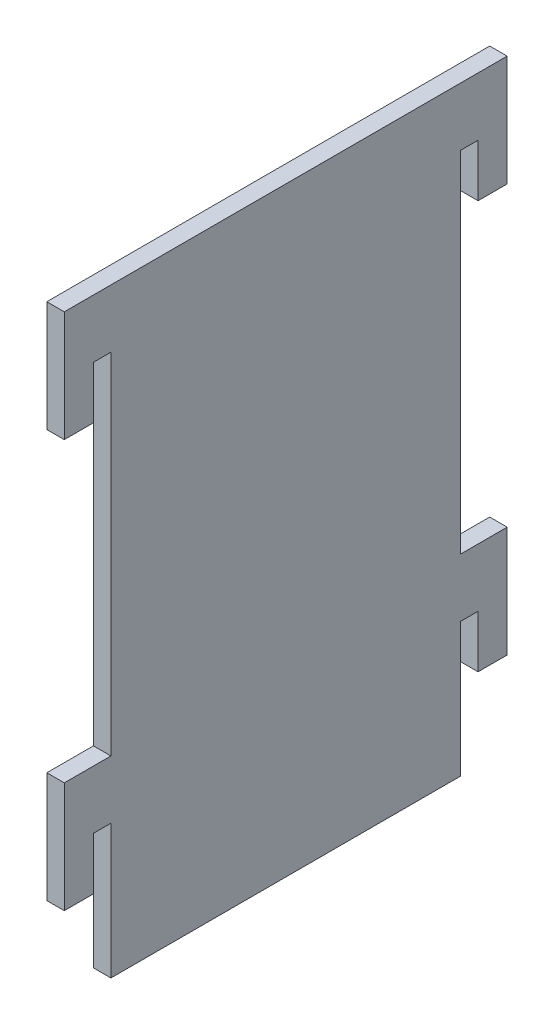
ISO-10303-21;
HEADER;
FILE_DESCRIPTION(('STEP AP214'),'2;1');
FILE_NAME('part.step','',(''),(''),'','','');
FILE_SCHEMA(('AUTOMOTIVE_DESIGN { 1 0 10303 214 1 1 1 1 }'));
ENDSEC;
DATA;
#1=APPLICATION_CONTEXT('core data for automotive mechanical design processes');
#2=APPLICATION_PROTOCOL_DEFINITION('international standard','automotive_design',2000,#1);
#3=PRODUCT_CONTEXT('',#1,'mechanical');
#4=PRODUCT('Part','Part','',(#3));
#5=PRODUCT_RELATED_PRODUCT_CATEGORY('part','',(#4));
#6=PRODUCT_DEFINITION_FORMATION('','',#4);
#7=PRODUCT_DEFINITION_CONTEXT('part definition',#1,'design');
#8=PRODUCT_DEFINITION('design','',#6,#7);
#9=PRODUCT_DEFINITION_SHAPE('','',#8);
#10=(LENGTH_UNIT() NAMED_UNIT(*) SI_UNIT(.MILLI.,.METRE.));
#11=(NAMED_UNIT(*) PLANE_ANGLE_UNIT() SI_UNIT($,.RADIAN.));
#12=(NAMED_UNIT(*) SI_UNIT($,.STERADIAN.) SOLID_ANGLE_UNIT());
#13=UNCERTAINTY_MEASURE_WITH_UNIT(LENGTH_MEASURE(1.E-05),#10,'distance_accuracy_value','');
#14=(GEOMETRIC_REPRESENTATION_CONTEXT(3) GLOBAL_UNCERTAINTY_ASSIGNED_CONTEXT((#13)) GLOBAL_UNIT_ASSIGNED_CONTEXT((#10,
#11,#12)) REPRESENTATION_CONTEXT('',''));
#15=CARTESIAN_POINT('',(0.,0.,0.));
#16=DIRECTION('',(0.,0.,1.));
#17=DIRECTION('',(1.,0.,0.));
#18=AXIS2_PLACEMENT_3D('',#15,#16,#17);
#19=CARTESIAN_POINT('',(3.,81.,5.));
#20=DIRECTION('',(0.,0.,-1.));
#21=DIRECTION('',(0.,1.,0.));
#22=AXIS2_PLACEMENT_3D('',#19,#20,#21);
#23=PLANE('',#22);
#24=DIRECTION('',(0.,-1.,0.));
#25=VECTOR('',#24,1.);
#26=CARTESIAN_POINT('',(0.,81.,5.));
#27=LINE('',#26,#25);
#28=CARTESIAN_POINT('',(0.,100.,5.));
#29=VERTEX_POINT('',#28);
#30=CARTESIAN_POINT('',(0.,81.,5.));
#31=VERTEX_POINT('',#30);
#32=EDGE_CURVE('E228',#29,#31,#27,.T.);
#33=ORIENTED_EDGE('',*,*,#32,.T.);
#34=DIRECTION('',(-1.,0.,0.));
#35=VECTOR('',#34,1.);
#36=CARTESIAN_POINT('',(3.,81.,5.));
#37=LINE('',#36,#35);
#38=CARTESIAN_POINT('',(3.,81.,5.));
#39=VERTEX_POINT('',#38);
#40=EDGE_CURVE('E43',#39,#31,#37,.T.);
#41=ORIENTED_EDGE('',*,*,#40,.F.);
#42=DIRECTION('',(0.,-1.,0.));
#43=VECTOR('',#42,1.);
#44=CARTESIAN_POINT('',(3.,81.,5.));
#45=LINE('',#44,#43);
#46=CARTESIAN_POINT('',(3.,100.,5.));
#47=VERTEX_POINT('',#46);
#48=EDGE_CURVE('E401',#47,#39,#45,.T.);
#49=ORIENTED_EDGE('',*,*,#48,.F.);
#50=DIRECTION('',(-1.,0.,0.));
#51=VECTOR('',#50,1.);
#52=CARTESIAN_POINT('',(3.,100.,5.));
#53=LINE('',#52,#51);
#54=EDGE_CURVE('E11',#47,#29,#53,.T.);
#55=ORIENTED_EDGE('',*,*,#54,.T.);
#56=EDGE_LOOP('',(#33,#41,#49,#55));
#57=FACE_BOUND('',#56,.T.);
#58=ADVANCED_FACE('F35',(#57),#23,.F.);
#59=CARTESIAN_POINT('',(3.,81.,0.));
#60=DIRECTION('',(0.,1.,0.));
#61=DIRECTION('',(0.,0.,1.));
#62=AXIS2_PLACEMENT_3D('',#59,#60,#61);
#63=PLANE('',#62);
#64=DIRECTION('',(0.,0.,-1.));
#65=VECTOR('',#64,1.);
#66=CARTESIAN_POINT('',(0.,81.,0.));
#67=LINE('',#66,#65);
#68=CARTESIAN_POINT('',(0.,81.,0.));
#69=VERTEX_POINT('',#68);
#70=EDGE_CURVE('E230',#31,#69,#67,.T.);
#71=ORIENTED_EDGE('',*,*,#70,.T.);
#72=DIRECTION('',(-1.,0.,0.));
#73=VECTOR('',#72,1.);
#74=CARTESIAN_POINT('',(3.,81.,0.));
#75=LINE('',#74,#73);
#76=CARTESIAN_POINT('',(3.,81.,0.));
#77=VERTEX_POINT('',#76);
#78=EDGE_CURVE('E327',#77,#69,#75,.T.);
#79=ORIENTED_EDGE('',*,*,#78,.F.);
#80=DIRECTION('',(0.,0.,-1.));
#81=VECTOR('',#80,1.);
#82=CARTESIAN_POINT('',(3.,81.,0.));
#83=LINE('',#82,#81);
#84=EDGE_CURVE('E336',#39,#77,#83,.T.);
#85=ORIENTED_EDGE('',*,*,#84,.F.);
#86=ORIENTED_EDGE('',*,*,#40,.T.);
#87=EDGE_LOOP('',(#71,#79,#85,#86));
#88=FACE_BOUND('',#87,.T.);
#89=ADVANCED_FACE('F334',(#88),#63,.F.);
#90=CARTESIAN_POINT('',(3.,81.,0.));
#91=DIRECTION('',(0.,0.,1.));
#92=DIRECTION('',(1.,0.,0.));
#93=AXIS2_PLACEMENT_3D('',#90,#91,#92);
#94=PLANE('',#93);
#95=DIRECTION('',(0.,1.,0.));
#96=VECTOR('',#95,1.);
#97=CARTESIAN_POINT('',(0.,81.,0.));
#98=LINE('',#97,#96);
#99=CARTESIAN_POINT('',(0.,90.,0.));
#100=VERTEX_POINT('',#99);
#101=EDGE_CURVE('E232',#69,#100,#98,.T.);
#102=ORIENTED_EDGE('',*,*,#101,.T.);
#103=DIRECTION('',(-1.,0.,0.));
#104=VECTOR('',#103,1.);
#105=CARTESIAN_POINT('',(3.,90.,0.));
#106=LINE('',#105,#104);
#107=CARTESIAN_POINT('',(3.,90.,0.));
#108=VERTEX_POINT('',#107);
#109=EDGE_CURVE('E324',#108,#100,#106,.T.);
#110=ORIENTED_EDGE('',*,*,#109,.F.);
#111=DIRECTION('',(0.,1.,0.));
#112=VECTOR('',#111,1.);
#113=CARTESIAN_POINT('',(3.,81.,0.));
#114=LINE('',#113,#112);
#115=EDGE_CURVE('E354',#77,#108,#114,.T.);
#116=ORIENTED_EDGE('',*,*,#115,.F.);
#117=ORIENTED_EDGE('',*,*,#78,.T.);
#118=EDGE_LOOP('',(#102,#110,#116,#117));
#119=FACE_BOUND('',#118,.T.);
#120=ADVANCED_FACE('F345',(#119),#94,.F.);
#121=CARTESIAN_POINT('',(3.,90.,0.));
#122=DIRECTION('',(0.,1.,0.));
#123=DIRECTION('',(0.,0.,1.));
#124=AXIS2_PLACEMENT_3D('',#121,#122,#123);
#125=PLANE('',#124);
#126=DIRECTION('',(0.,0.,-1.));
#127=VECTOR('',#126,1.);
#128=CARTESIAN_POINT('',(0.,90.,0.));
#129=LINE('',#128,#127);
#130=CARTESIAN_POINT('',(0.,90.,-3.00000000000001));
#131=VERTEX_POINT('',#130);
#132=EDGE_CURVE('E234',#100,#131,#129,.T.);
#133=ORIENTED_EDGE('',*,*,#132,.T.);
#134=DIRECTION('',(-1.,0.,0.));
#135=VECTOR('',#134,1.);
#136=CARTESIAN_POINT('',(3.,90.,-3.00000000000001));
#137=LINE('',#136,#135);
#138=CARTESIAN_POINT('',(3.,90.,-3.00000000000001));
#139=VERTEX_POINT('',#138);
#140=EDGE_CURVE('E321',#139,#131,#137,.T.);
#141=ORIENTED_EDGE('',*,*,#140,.F.);
#142=DIRECTION('',(0.,0.,-1.));
#143=VECTOR('',#142,1.);
#144=CARTESIAN_POINT('',(3.,90.,0.));
#145=LINE('',#144,#143);
#146=EDGE_CURVE('E351',#108,#139,#145,.T.);
#147=ORIENTED_EDGE('',*,*,#146,.F.);
#148=ORIENTED_EDGE('',*,*,#109,.T.);
#149=EDGE_LOOP('',(#133,#141,#147,#148));
#150=FACE_BOUND('',#149,.T.);
#151=ADVANCED_FACE('F349',(#150),#125,.F.);
#152=CARTESIAN_POINT('',(3.,90.,-3.00000000000001));
#153=DIRECTION('',(0.,0.,-1.));
#154=DIRECTION('',(0.,1.,0.));
#155=AXIS2_PLACEMENT_3D('',#152,#153,#154);
#156=PLANE('',#155);
#157=DIRECTION('',(0.,-1.,0.));
#158=VECTOR('',#157,1.);
#159=CARTESIAN_POINT('',(0.,90.,-3.00000000000001));
#160=LINE('',#159,#158);
#161=CARTESIAN_POINT('',(0.,30.,-3.00000000000002));
#162=VERTEX_POINT('',#161);
#163=EDGE_CURVE('E236',#131,#162,#160,.T.);
#164=ORIENTED_EDGE('',*,*,#163,.T.);
#165=DIRECTION('',(-1.,0.,0.));
#166=VECTOR('',#165,1.);
#167=CARTESIAN_POINT('',(3.,30.,-3.00000000000002));
#168=LINE('',#167,#166);
#169=CARTESIAN_POINT('',(3.,30.,-3.00000000000002));
#170=VERTEX_POINT('',#169);
#171=EDGE_CURVE('E318',#170,#162,#168,.T.);
#172=ORIENTED_EDGE('',*,*,#171,.F.);
#173=DIRECTION('',(0.,-1.,0.));
#174=VECTOR('',#173,1.);
#175=CARTESIAN_POINT('',(3.,90.,-3.00000000000001));
#176=LINE('',#175,#174);
#177=EDGE_CURVE('E353',#139,#170,#176,.T.);
#178=ORIENTED_EDGE('',*,*,#177,.F.);
#179=ORIENTED_EDGE('',*,*,#140,.T.);
#180=EDGE_LOOP('',(#164,#172,#178,#179));
#181=FACE_BOUND('',#180,.T.);
#182=ADVANCED_FACE('F415',(#181),#156,.F.);
#183=CARTESIAN_POINT('',(3.,30.,-3.00000000000002));
#184=DIRECTION('',(0.,-1.,0.));
#185=DIRECTION('',(0.,0.,-1.));
#186=AXIS2_PLACEMENT_3D('',#183,#184,#185);
#187=PLANE('',#186);
#188=DIRECTION('',(0.,0.,1.));
#189=VECTOR('',#188,1.);
#190=CARTESIAN_POINT('',(0.,30.,-3.00000000000002));
#191=LINE('',#190,#189);
#192=CARTESIAN_POINT('',(0.,30.,5.));
#193=VERTEX_POINT('',#192);
#194=EDGE_CURVE('E238',#162,#193,#191,.T.);
#195=ORIENTED_EDGE('',*,*,#194,.T.);
#196=DIRECTION('',(-1.,0.,0.));
#197=VECTOR('',#196,1.);
#198=CARTESIAN_POINT('',(3.,30.,5.));
#199=LINE('',#198,#197);
#200=CARTESIAN_POINT('',(3.,30.,5.));
#201=VERTEX_POINT('',#200);
#202=EDGE_CURVE('E315',#201,#193,#199,.T.);
#203=ORIENTED_EDGE('',*,*,#202,.F.);
#204=DIRECTION('',(0.,0.,1.));
#205=VECTOR('',#204,1.);
#206=CARTESIAN_POINT('',(3.,30.,-3.00000000000002));
#207=LINE('',#206,#205);
#208=EDGE_CURVE('E356',#170,#201,#207,.T.);
#209=ORIENTED_EDGE('',*,*,#208,.F.);
#210=ORIENTED_EDGE('',*,*,#171,.T.);
#211=EDGE_LOOP('',(#195,#203,#209,#210));
#212=FACE_BOUND('',#211,.T.);
#213=ADVANCED_FACE('F418',(#212),#187,.F.);
#214=CARTESIAN_POINT('',(3.,30.,5.));
#215=DIRECTION('',(0.,0.,-1.));
#216=DIRECTION('',(0.,1.,0.));
#217=AXIS2_PLACEMENT_3D('',#214,#215,#216);
#218=PLANE('',#217);
#219=DIRECTION('',(0.,-1.,0.));
#220=VECTOR('',#219,1.);
#221=CARTESIAN_POINT('',(0.,30.,5.));
#222=LINE('',#221,#220);
#223=CARTESIAN_POINT('',(0.,11.,5.));
#224=VERTEX_POINT('',#223);
#225=EDGE_CURVE('E240',#193,#224,#222,.T.);
#226=ORIENTED_EDGE('',*,*,#225,.T.);
#227=DIRECTION('',(-1.,0.,0.));
#228=VECTOR('',#227,1.);
#229=CARTESIAN_POINT('',(3.,11.,5.));
#230=LINE('',#229,#228);
#231=CARTESIAN_POINT('',(3.,11.,5.));
#232=VERTEX_POINT('',#231);
#233=EDGE_CURVE('E312',#232,#224,#230,.T.);
#234=ORIENTED_EDGE('',*,*,#233,.F.);
#235=DIRECTION('',(0.,-1.,0.));
#236=VECTOR('',#235,1.);
#237=CARTESIAN_POINT('',(3.,30.,5.));
#238=LINE('',#237,#236);
#239=EDGE_CURVE('E362',#201,#232,#238,.T.);
#240=ORIENTED_EDGE('',*,*,#239,.F.);
#241=ORIENTED_EDGE('',*,*,#202,.T.);
#242=EDGE_LOOP('',(#226,#234,#240,#241));
#243=FACE_BOUND('',#242,.T.);
#244=ADVANCED_FACE('F422',(#243),#218,.F.);
#245=CARTESIAN_POINT('',(3.,11.,0.));
#246=DIRECTION('',(0.,1.,0.));
#247=DIRECTION('',(0.,0.,1.));
#248=AXIS2_PLACEMENT_3D('',#245,#246,#247);
#249=PLANE('',#248);
#250=DIRECTION('',(0.,0.,-1.));
#251=VECTOR('',#250,1.);
#252=CARTESIAN_POINT('',(0.,11.,0.));
#253=LINE('',#252,#251);
#254=CARTESIAN_POINT('',(0.,11.,0.));
#255=VERTEX_POINT('',#254);
#256=EDGE_CURVE('E242',#224,#255,#253,.T.);
#257=ORIENTED_EDGE('',*,*,#256,.T.);
#258=DIRECTION('',(-1.,0.,0.));
#259=VECTOR('',#258,1.);
#260=CARTESIAN_POINT('',(3.,11.,0.));
#261=LINE('',#260,#259);
#262=CARTESIAN_POINT('',(3.,11.,0.));
#263=VERTEX_POINT('',#262);
#264=EDGE_CURVE('E309',#263,#255,#261,.T.);
#265=ORIENTED_EDGE('',*,*,#264,.F.);
#266=DIRECTION('',(0.,0.,-1.));
#267=VECTOR('',#266,1.);
#268=CARTESIAN_POINT('',(3.,11.,0.));
#269=LINE('',#268,#267);
#270=EDGE_CURVE('E364',#232,#263,#269,.T.);
#271=ORIENTED_EDGE('',*,*,#270,.F.);
#272=ORIENTED_EDGE('',*,*,#233,.T.);
#273=EDGE_LOOP('',(#257,#265,#271,#272));
#274=FACE_BOUND('',#273,.T.);
#275=ADVANCED_FACE('F426',(#274),#249,.F.);
#276=CARTESIAN_POINT('',(3.,20.,0.));
#277=DIRECTION('',(0.,0.,1.));
#278=DIRECTION('',(1.,0.,0.));
#279=AXIS2_PLACEMENT_3D('',#276,#277,#278);
#280=PLANE('',#279);
#281=DIRECTION('',(0.,1.,0.));
#282=VECTOR('',#281,1.);
#283=CARTESIAN_POINT('',(0.,20.,0.));
#284=LINE('',#283,#282);
#285=CARTESIAN_POINT('',(0.,20.,0.));
#286=VERTEX_POINT('',#285);
#287=EDGE_CURVE('E244',#255,#286,#284,.T.);
#288=ORIENTED_EDGE('',*,*,#287,.T.);
#289=DIRECTION('',(-1.,0.,0.));
#290=VECTOR('',#289,1.);
#291=CARTESIAN_POINT('',(3.,20.,0.));
#292=LINE('',#291,#290);
#293=CARTESIAN_POINT('',(3.,20.,0.));
#294=VERTEX_POINT('',#293);
#295=EDGE_CURVE('E306',#294,#286,#292,.T.);
#296=ORIENTED_EDGE('',*,*,#295,.F.);
#297=DIRECTION('',(0.,1.,0.));
#298=VECTOR('',#297,1.);
#299=CARTESIAN_POINT('',(3.,20.,0.));
#300=LINE('',#299,#298);
#301=EDGE_CURVE('E366',#263,#294,#300,.T.);
#302=ORIENTED_EDGE('',*,*,#301,.F.);
#303=ORIENTED_EDGE('',*,*,#264,.T.);
#304=EDGE_LOOP('',(#288,#296,#302,#303));
#305=FACE_BOUND('',#304,.T.);
#306=ADVANCED_FACE('F430',(#305),#280,.F.);
#307=CARTESIAN_POINT('',(3.,20.,-3.00000000000002));
#308=DIRECTION('',(0.,1.,0.));
#309=DIRECTION('',(0.,0.,1.));
#310=AXIS2_PLACEMENT_3D('',#307,#308,#309);
#311=PLANE('',#310);
#312=DIRECTION('',(0.,0.,-1.));
#313=VECTOR('',#312,1.);
#314=CARTESIAN_POINT('',(0.,20.,-3.00000000000002));
#315=LINE('',#314,#313);
#316=CARTESIAN_POINT('',(0.,20.,-3.00000000000002));
#317=VERTEX_POINT('',#316);
#318=EDGE_CURVE('E246',#286,#317,#315,.T.);
#319=ORIENTED_EDGE('',*,*,#318,.T.);
#320=DIRECTION('',(-1.,0.,0.));
#321=VECTOR('',#320,1.);
#322=CARTESIAN_POINT('',(3.,20.,-3.00000000000002));
#323=LINE('',#322,#321);
#324=CARTESIAN_POINT('',(3.,20.,-3.00000000000002));
#325=VERTEX_POINT('',#324);
#326=EDGE_CURVE('E303',#325,#317,#323,.T.);
#327=ORIENTED_EDGE('',*,*,#326,.F.);
#328=DIRECTION('',(0.,0.,-1.));
#329=VECTOR('',#328,1.);
#330=CARTESIAN_POINT('',(3.,20.,-3.00000000000002));
#331=LINE('',#330,#329);
#332=EDGE_CURVE('E368',#294,#325,#331,.T.);
#333=ORIENTED_EDGE('',*,*,#332,.F.);
#334=ORIENTED_EDGE('',*,*,#295,.T.);
#335=EDGE_LOOP('',(#319,#327,#333,#334));
#336=FACE_BOUND('',#335,.T.);
#337=ADVANCED_FACE('F434',(#336),#311,.F.);
#338=CARTESIAN_POINT('',(3.,20.,-3.00000000000002));
#339=DIRECTION('',(0.,0.,-1.));
#340=DIRECTION('',(0.,1.,0.));
#341=AXIS2_PLACEMENT_3D('',#338,#339,#340);
#342=PLANE('',#341);
#343=DIRECTION('',(0.,-1.,0.));
#344=VECTOR('',#343,1.);
#345=CARTESIAN_POINT('',(0.,20.,-3.00000000000002));
#346=LINE('',#345,#344);
#347=CARTESIAN_POINT('',(0.,-3.,-3.00000000000001));
#348=VERTEX_POINT('',#347);
#349=EDGE_CURVE('E248',#317,#348,#346,.T.);
#350=ORIENTED_EDGE('',*,*,#349,.T.);
#351=DIRECTION('',(-1.,0.,0.));
#352=VECTOR('',#351,1.);
#353=CARTESIAN_POINT('',(3.,-3.,-3.00000000000001));
#354=LINE('',#353,#352);
#355=CARTESIAN_POINT('',(3.,-3.,-3.00000000000001));
#356=VERTEX_POINT('',#355);
#357=EDGE_CURVE('E300',#356,#348,#354,.T.);
#358=ORIENTED_EDGE('',*,*,#357,.F.);
#359=DIRECTION('',(0.,-1.,0.));
#360=VECTOR('',#359,1.);
#361=CARTESIAN_POINT('',(3.,20.,-3.00000000000002));
#362=LINE('',#361,#360);
#363=EDGE_CURVE('E370',#325,#356,#362,.T.);
#364=ORIENTED_EDGE('',*,*,#363,.F.);
#365=ORIENTED_EDGE('',*,*,#326,.T.);
#366=EDGE_LOOP('',(#350,#358,#364,#365));
#367=FACE_BOUND('',#366,.T.);
#368=ADVANCED_FACE('F438',(#367),#342,.F.);
#369=CARTESIAN_POINT('',(3.,-3.,-3.00000000000001));
#370=DIRECTION('',(0.,1.,0.));
#371=DIRECTION('',(0.,0.,1.));
#372=AXIS2_PLACEMENT_3D('',#369,#370,#371);
#373=PLANE('',#372);
#374=DIRECTION('',(0.,0.,-1.));
#375=VECTOR('',#374,1.);
#376=CARTESIAN_POINT('',(0.,-3.,-3.00000000000001));
#377=LINE('',#376,#375);
#378=CARTESIAN_POINT('',(0.,-3.,-63.));
#379=VERTEX_POINT('',#378);
#380=EDGE_CURVE('E250',#348,#379,#377,.T.);
#381=ORIENTED_EDGE('',*,*,#380,.T.);
#382=DIRECTION('',(-1.,0.,0.));
#383=VECTOR('',#382,1.);
#384=CARTESIAN_POINT('',(3.,-3.,-63.));
#385=LINE('',#384,#383);
#386=CARTESIAN_POINT('',(3.,-3.,-63.));
#387=VERTEX_POINT('',#386);
#388=EDGE_CURVE('E297',#387,#379,#385,.T.);
#389=ORIENTED_EDGE('',*,*,#388,.F.);
#390=DIRECTION('',(0.,0.,-1.));
#391=VECTOR('',#390,1.);
#392=CARTESIAN_POINT('',(3.,-3.,-3.00000000000001));
#393=LINE('',#392,#391);
#394=EDGE_CURVE('E372',#356,#387,#393,.T.);
#395=ORIENTED_EDGE('',*,*,#394,.F.);
#396=ORIENTED_EDGE('',*,*,#357,.T.);
#397=EDGE_LOOP('',(#381,#389,#395,#396));
#398=FACE_BOUND('',#397,.T.);
#399=ADVANCED_FACE('F442',(#398),#373,.F.);
#400=CARTESIAN_POINT('',(3.,20.,-63.));
#401=DIRECTION('',(0.,0.,1.));
#402=DIRECTION('',(1.,0.,0.));
#403=AXIS2_PLACEMENT_3D('',#400,#401,#402);
#404=PLANE('',#403);
#405=DIRECTION('',(0.,1.,0.));
#406=VECTOR('',#405,1.);
#407=CARTESIAN_POINT('',(0.,20.,-63.));
#408=LINE('',#407,#406);
#409=CARTESIAN_POINT('',(0.,20.,-63.));
#410=VERTEX_POINT('',#409);
#411=EDGE_CURVE('E252',#379,#410,#408,.T.);
#412=ORIENTED_EDGE('',*,*,#411,.T.);
#413=DIRECTION('',(-1.,0.,0.));
#414=VECTOR('',#413,1.);
#415=CARTESIAN_POINT('',(3.,20.,-63.));
#416=LINE('',#415,#414);
#417=CARTESIAN_POINT('',(3.,20.,-63.));
#418=VERTEX_POINT('',#417);
#419=EDGE_CURVE('E294',#418,#410,#416,.T.);
#420=ORIENTED_EDGE('',*,*,#419,.F.);
#421=DIRECTION('',(0.,1.,0.));
#422=VECTOR('',#421,1.);
#423=CARTESIAN_POINT('',(3.,20.,-63.));
#424=LINE('',#423,#422);
#425=EDGE_CURVE('E374',#387,#418,#424,.T.);
#426=ORIENTED_EDGE('',*,*,#425,.F.);
#427=ORIENTED_EDGE('',*,*,#388,.T.);
#428=EDGE_LOOP('',(#412,#420,#426,#427));
#429=FACE_BOUND('',#428,.T.);
#430=ADVANCED_FACE('F446',(#429),#404,.F.);
#431=CARTESIAN_POINT('',(3.,20.,-63.));
#432=DIRECTION('',(0.,1.,0.));
#433=DIRECTION('',(0.,0.,1.));
#434=AXIS2_PLACEMENT_3D('',#431,#432,#433);
#435=PLANE('',#434);
#436=DIRECTION('',(0.,0.,-1.));
#437=VECTOR('',#436,1.);
#438=CARTESIAN_POINT('',(0.,20.,-63.));
#439=LINE('',#438,#437);
#440=CARTESIAN_POINT('',(0.,20.,-66.));
#441=VERTEX_POINT('',#440);
#442=EDGE_CURVE('E254',#410,#441,#439,.T.);
#443=ORIENTED_EDGE('',*,*,#442,.T.);
#444=DIRECTION('',(-1.,0.,0.));
#445=VECTOR('',#444,1.);
#446=CARTESIAN_POINT('',(3.,20.,-66.));
#447=LINE('',#446,#445);
#448=CARTESIAN_POINT('',(3.,20.,-66.));
#449=VERTEX_POINT('',#448);
#450=EDGE_CURVE('E291',#449,#441,#447,.T.);
#451=ORIENTED_EDGE('',*,*,#450,.F.);
#452=DIRECTION('',(0.,0.,-1.));
#453=VECTOR('',#452,1.);
#454=CARTESIAN_POINT('',(3.,20.,-63.));
#455=LINE('',#454,#453);
#456=EDGE_CURVE('E376',#418,#449,#455,.T.);
#457=ORIENTED_EDGE('',*,*,#456,.F.);
#458=ORIENTED_EDGE('',*,*,#419,.T.);
#459=EDGE_LOOP('',(#443,#451,#457,#458));
#460=FACE_BOUND('',#459,.T.);
#461=ADVANCED_FACE('F450',(#460),#435,.F.);
#462=CARTESIAN_POINT('',(3.,20.,-66.));
#463=DIRECTION('',(0.,0.,-1.));
#464=DIRECTION('',(-1.,0.,0.));
#465=AXIS2_PLACEMENT_3D('',#462,#463,#464);
#466=PLANE('',#465);
#467=DIRECTION('',(0.,-1.,0.));
#468=VECTOR('',#467,1.);
#469=CARTESIAN_POINT('',(0.,20.,-66.));
#470=LINE('',#469,#468);
#471=CARTESIAN_POINT('',(0.,11.,-66.));
#472=VERTEX_POINT('',#471);
#473=EDGE_CURVE('E256',#441,#472,#470,.T.);
#474=ORIENTED_EDGE('',*,*,#473,.T.);
#475=DIRECTION('',(-1.,0.,0.));
#476=VECTOR('',#475,1.);
#477=CARTESIAN_POINT('',(3.,11.,-66.));
#478=LINE('',#477,#476);
#479=CARTESIAN_POINT('',(3.,11.,-66.));
#480=VERTEX_POINT('',#479);
#481=EDGE_CURVE('E288',#480,#472,#478,.T.);
#482=ORIENTED_EDGE('',*,*,#481,.F.);
#483=DIRECTION('',(0.,-1.,0.));
#484=VECTOR('',#483,1.);
#485=CARTESIAN_POINT('',(3.,20.,-66.));
#486=LINE('',#485,#484);
#487=EDGE_CURVE('E378',#449,#480,#486,.T.);
#488=ORIENTED_EDGE('',*,*,#487,.F.);
#489=ORIENTED_EDGE('',*,*,#450,.T.);
#490=EDGE_LOOP('',(#474,#482,#488,#489));
#491=FACE_BOUND('',#490,.T.);
#492=ADVANCED_FACE('F454',(#491),#466,.F.);
#493=CARTESIAN_POINT('',(3.,11.,-66.));
#494=DIRECTION('',(0.,1.,0.));
#495=DIRECTION('',(0.,0.,1.));
#496=AXIS2_PLACEMENT_3D('',#493,#494,#495);
#497=PLANE('',#496);
#498=DIRECTION('',(0.,0.,-1.));
#499=VECTOR('',#498,1.);
#500=CARTESIAN_POINT('',(0.,11.,-66.));
#501=LINE('',#500,#499);
#502=CARTESIAN_POINT('',(0.,11.,-71.));
#503=VERTEX_POINT('',#502);
#504=EDGE_CURVE('E258',#472,#503,#501,.T.);
#505=ORIENTED_EDGE('',*,*,#504,.T.);
#506=DIRECTION('',(-1.,0.,0.));
#507=VECTOR('',#506,1.);
#508=CARTESIAN_POINT('',(3.,11.,-71.));
#509=LINE('',#508,#507);
#510=CARTESIAN_POINT('',(3.,11.,-71.));
#511=VERTEX_POINT('',#510);
#512=EDGE_CURVE('E285',#511,#503,#509,.T.);
#513=ORIENTED_EDGE('',*,*,#512,.F.);
#514=DIRECTION('',(0.,0.,-1.));
#515=VECTOR('',#514,1.);
#516=CARTESIAN_POINT('',(3.,11.,-66.));
#517=LINE('',#516,#515);
#518=EDGE_CURVE('E380',#480,#511,#517,.T.);
#519=ORIENTED_EDGE('',*,*,#518,.F.);
#520=ORIENTED_EDGE('',*,*,#481,.T.);
#521=EDGE_LOOP('',(#505,#513,#519,#520));
#522=FACE_BOUND('',#521,.T.);
#523=ADVANCED_FACE('F458',(#522),#497,.F.);
#524=CARTESIAN_POINT('',(3.,11.,-71.));
#525=DIRECTION('',(0.,0.,1.));
#526=DIRECTION('',(1.,0.,0.));
#527=AXIS2_PLACEMENT_3D('',#524,#525,#526);
#528=PLANE('',#527);
#529=DIRECTION('',(0.,1.,0.));
#530=VECTOR('',#529,1.);
#531=CARTESIAN_POINT('',(0.,11.,-71.));
#532=LINE('',#531,#530);
#533=CARTESIAN_POINT('',(0.,30.,-71.));
#534=VERTEX_POINT('',#533);
#535=EDGE_CURVE('E260',#503,#534,#532,.T.);
#536=ORIENTED_EDGE('',*,*,#535,.T.);
#537=DIRECTION('',(-1.,0.,0.));
#538=VECTOR('',#537,1.);
#539=CARTESIAN_POINT('',(3.,30.,-71.));
#540=LINE('',#539,#538);
#541=CARTESIAN_POINT('',(3.,30.,-71.));
#542=VERTEX_POINT('',#541);
#543=EDGE_CURVE('E282',#542,#534,#540,.T.);
#544=ORIENTED_EDGE('',*,*,#543,.F.);
#545=DIRECTION('',(0.,1.,0.));
#546=VECTOR('',#545,1.);
#547=CARTESIAN_POINT('',(3.,11.,-71.));
#548=LINE('',#547,#546);
#549=EDGE_CURVE('E382',#511,#542,#548,.T.);
#550=ORIENTED_EDGE('',*,*,#549,.F.);
#551=ORIENTED_EDGE('',*,*,#512,.T.);
#552=EDGE_LOOP('',(#536,#544,#550,#551));
#553=FACE_BOUND('',#552,.T.);
#554=ADVANCED_FACE('F462',(#553),#528,.F.);
#555=CARTESIAN_POINT('',(3.,30.,-71.));
#556=DIRECTION('',(0.,-1.,0.));
#557=DIRECTION('',(0.,0.,-1.));
#558=AXIS2_PLACEMENT_3D('',#555,#556,#557);
#559=PLANE('',#558);
#560=DIRECTION('',(0.,0.,1.));
#561=VECTOR('',#560,1.);
#562=CARTESIAN_POINT('',(0.,30.,-71.));
#563=LINE('',#562,#561);
#564=CARTESIAN_POINT('',(0.,30.,-63.));
#565=VERTEX_POINT('',#564);
#566=EDGE_CURVE('E262',#534,#565,#563,.T.);
#567=ORIENTED_EDGE('',*,*,#566,.T.);
#568=DIRECTION('',(-1.,0.,0.));
#569=VECTOR('',#568,1.);
#570=CARTESIAN_POINT('',(3.,30.,-63.));
#571=LINE('',#570,#569);
#572=CARTESIAN_POINT('',(3.,30.,-63.));
#573=VERTEX_POINT('',#572);
#574=EDGE_CURVE('E279',#573,#565,#571,.T.);
#575=ORIENTED_EDGE('',*,*,#574,.F.);
#576=DIRECTION('',(0.,0.,1.));
#577=VECTOR('',#576,1.);
#578=CARTESIAN_POINT('',(3.,30.,-71.));
#579=LINE('',#578,#577);
#580=EDGE_CURVE('E384',#542,#573,#579,.T.);
#581=ORIENTED_EDGE('',*,*,#580,.F.);
#582=ORIENTED_EDGE('',*,*,#543,.T.);
#583=EDGE_LOOP('',(#567,#575,#581,#582));
#584=FACE_BOUND('',#583,.T.);
#585=ADVANCED_FACE('F466',(#584),#559,.F.);
#586=CARTESIAN_POINT('',(3.,90.,-63.));
#587=DIRECTION('',(0.,0.,1.));
#588=DIRECTION('',(1.,0.,0.));
#589=AXIS2_PLACEMENT_3D('',#586,#587,#588);
#590=PLANE('',#589);
#591=DIRECTION('',(0.,1.,0.));
#592=VECTOR('',#591,1.);
#593=CARTESIAN_POINT('',(0.,90.,-63.));
#594=LINE('',#593,#592);
#595=CARTESIAN_POINT('',(0.,90.,-63.));
#596=VERTEX_POINT('',#595);
#597=EDGE_CURVE('E264',#565,#596,#594,.T.);
#598=ORIENTED_EDGE('',*,*,#597,.T.);
#599=DIRECTION('',(-1.,0.,0.));
#600=VECTOR('',#599,1.);
#601=CARTESIAN_POINT('',(3.,90.,-63.));
#602=LINE('',#601,#600);
#603=CARTESIAN_POINT('',(3.,90.,-63.));
#604=VERTEX_POINT('',#603);
#605=EDGE_CURVE('E276',#604,#596,#602,.T.);
#606=ORIENTED_EDGE('',*,*,#605,.F.);
#607=DIRECTION('',(0.,1.,0.));
#608=VECTOR('',#607,1.);
#609=CARTESIAN_POINT('',(3.,90.,-63.));
#610=LINE('',#609,#608);
#611=EDGE_CURVE('E386',#573,#604,#610,.T.);
#612=ORIENTED_EDGE('',*,*,#611,.F.);
#613=ORIENTED_EDGE('',*,*,#574,.T.);
#614=EDGE_LOOP('',(#598,#606,#612,#613));
#615=FACE_BOUND('',#614,.T.);
#616=ADVANCED_FACE('F392',(#615),#590,.F.);
#617=CARTESIAN_POINT('',(3.,90.,-66.));
#618=DIRECTION('',(0.,1.,0.));
#619=DIRECTION('',(0.,0.,1.));
#620=AXIS2_PLACEMENT_3D('',#617,#618,#619);
#621=PLANE('',#620);
#622=DIRECTION('',(0.,0.,-1.));
#623=VECTOR('',#622,1.);
#624=CARTESIAN_POINT('',(0.,90.,-66.));
#625=LINE('',#624,#623);
#626=CARTESIAN_POINT('',(0.,90.,-66.));
#627=VERTEX_POINT('',#626);
#628=EDGE_CURVE('E266',#596,#627,#625,.T.);
#629=ORIENTED_EDGE('',*,*,#628,.T.);
#630=DIRECTION('',(-1.,0.,0.));
#631=VECTOR('',#630,1.);
#632=CARTESIAN_POINT('',(3.,90.,-66.));
#633=LINE('',#632,#631);
#634=CARTESIAN_POINT('',(3.,90.,-66.));
#635=VERTEX_POINT('',#634);
#636=EDGE_CURVE('E217',#635,#627,#633,.T.);
#637=ORIENTED_EDGE('',*,*,#636,.F.);
#638=DIRECTION('',(0.,0.,-1.));
#639=VECTOR('',#638,1.);
#640=CARTESIAN_POINT('',(3.,90.,-66.));
#641=LINE('',#640,#639);
#642=EDGE_CURVE('E208',#604,#635,#641,.T.);
#643=ORIENTED_EDGE('',*,*,#642,.F.);
#644=ORIENTED_EDGE('',*,*,#605,.T.);
#645=EDGE_LOOP('',(#629,#637,#643,#644));
#646=FACE_BOUND('',#645,.T.);
#647=ADVANCED_FACE('F396',(#646),#621,.F.);
#648=CARTESIAN_POINT('',(3.,81.,-66.));
#649=DIRECTION('',(0.,0.,-1.));
#650=DIRECTION('',(-1.,0.,0.));
#651=AXIS2_PLACEMENT_3D('',#648,#649,#650);
#652=PLANE('',#651);
#653=DIRECTION('',(0.,-1.,0.));
#654=VECTOR('',#653,1.);
#655=CARTESIAN_POINT('',(0.,81.,-66.));
#656=LINE('',#655,#654);
#657=CARTESIAN_POINT('',(0.,81.,-66.));
#658=VERTEX_POINT('',#657);
#659=EDGE_CURVE('E216',#627,#658,#656,.T.);
#660=ORIENTED_EDGE('',*,*,#659,.T.);
#661=DIRECTION('',(-1.,0.,0.));
#662=VECTOR('',#661,1.);
#663=CARTESIAN_POINT('',(3.,81.,-66.));
#664=LINE('',#663,#662);
#665=CARTESIAN_POINT('',(3.,81.,-66.));
#666=VERTEX_POINT('',#665);
#667=EDGE_CURVE('E213',#666,#658,#664,.T.);
#668=ORIENTED_EDGE('',*,*,#667,.F.);
#669=DIRECTION('',(0.,-1.,0.));
#670=VECTOR('',#669,1.);
#671=CARTESIAN_POINT('',(3.,81.,-66.));
#672=LINE('',#671,#670);
#673=EDGE_CURVE('E202',#635,#666,#672,.T.);
#674=ORIENTED_EDGE('',*,*,#673,.F.);
#675=ORIENTED_EDGE('',*,*,#636,.T.);
#676=EDGE_LOOP('',(#660,#668,#674,#675));
#677=FACE_BOUND('',#676,.T.);
#678=ADVANCED_FACE('F214',(#677),#652,.F.);
#679=CARTESIAN_POINT('',(3.,81.,-71.));
#680=DIRECTION('',(0.,1.,0.));
#681=DIRECTION('',(0.,0.,1.));
#682=AXIS2_PLACEMENT_3D('',#679,#680,#681);
#683=PLANE('',#682);
#684=DIRECTION('',(0.,0.,-1.));
#685=VECTOR('',#684,1.);
#686=CARTESIAN_POINT('',(0.,81.,-71.));
#687=LINE('',#686,#685);
#688=CARTESIAN_POINT('',(0.,81.,-71.));
#689=VERTEX_POINT('',#688);
#690=EDGE_CURVE('E129',#658,#689,#687,.T.);
#691=ORIENTED_EDGE('',*,*,#690,.T.);
#692=DIRECTION('',(-1.,0.,0.));
#693=VECTOR('',#692,1.);
#694=CARTESIAN_POINT('',(3.,81.,-71.));
#695=LINE('',#694,#693);
#696=CARTESIAN_POINT('',(3.,81.,-71.));
#697=VERTEX_POINT('',#696);
#698=EDGE_CURVE('E218',#697,#689,#695,.T.);
#699=ORIENTED_EDGE('',*,*,#698,.F.);
#700=DIRECTION('',(0.,0.,-1.));
#701=VECTOR('',#700,1.);
#702=CARTESIAN_POINT('',(3.,81.,-71.));
#703=LINE('',#702,#701);
#704=EDGE_CURVE('E206',#666,#697,#703,.T.);
#705=ORIENTED_EDGE('',*,*,#704,.F.);
#706=ORIENTED_EDGE('',*,*,#667,.T.);
#707=EDGE_LOOP('',(#691,#699,#705,#706));
#708=FACE_BOUND('',#707,.T.);
#709=ADVANCED_FACE('F220',(#708),#683,.F.);
#710=CARTESIAN_POINT('',(3.,100.,-71.));
#711=DIRECTION('',(0.,0.,1.));
#712=DIRECTION('',(1.,0.,0.));
#713=AXIS2_PLACEMENT_3D('',#710,#711,#712);
#714=PLANE('',#713);
#715=DIRECTION('',(0.,1.,0.));
#716=VECTOR('',#715,1.);
#717=CARTESIAN_POINT('',(0.,100.,-71.));
#718=LINE('',#717,#716);
#719=CARTESIAN_POINT('',(0.,100.,-71.));
#720=VERTEX_POINT('',#719);
#721=EDGE_CURVE('E270',#689,#720,#718,.T.);
#722=ORIENTED_EDGE('',*,*,#721,.T.);
#723=DIRECTION('',(-1.,0.,0.));
#724=VECTOR('',#723,1.);
#725=CARTESIAN_POINT('',(3.,100.,-71.));
#726=LINE('',#725,#724);
#727=CARTESIAN_POINT('',(3.,100.,-71.));
#728=VERTEX_POINT('',#727);
#729=EDGE_CURVE('E224',#728,#720,#726,.T.);
#730=ORIENTED_EDGE('',*,*,#729,.F.);
#731=DIRECTION('',(0.,1.,0.));
#732=VECTOR('',#731,1.);
#733=CARTESIAN_POINT('',(3.,100.,-71.));
#734=LINE('',#733,#732);
#735=EDGE_CURVE('E222',#697,#728,#734,.T.);
#736=ORIENTED_EDGE('',*,*,#735,.F.);
#737=ORIENTED_EDGE('',*,*,#698,.T.);
#738=EDGE_LOOP('',(#722,#730,#736,#737));
#739=FACE_BOUND('',#738,.T.);
#740=ADVANCED_FACE('F399',(#739),#714,.F.);
#741=CARTESIAN_POINT('',(3.,100.,-63.));
#742=DIRECTION('',(0.,-1.,0.));
#743=DIRECTION('',(0.,0.,-1.));
#744=AXIS2_PLACEMENT_3D('',#741,#742,#743);
#745=PLANE('',#744);
#746=DIRECTION('',(0.,0.,1.));
#747=VECTOR('',#746,1.);
#748=CARTESIAN_POINT('',(0.,100.,-63.));
#749=LINE('',#748,#747);
#750=EDGE_CURVE('E136',#720,#29,#749,.T.);
#751=ORIENTED_EDGE('',*,*,#750,.T.);
#752=ORIENTED_EDGE('',*,*,#54,.F.);
#753=DIRECTION('',(0.,0.,1.));
#754=VECTOR('',#753,1.);
#755=CARTESIAN_POINT('',(3.,100.,-3.00000000000001));
#756=LINE('',#755,#754);
#757=EDGE_CURVE('E51',#728,#47,#756,.T.);
#758=ORIENTED_EDGE('',*,*,#757,.F.);
#759=ORIENTED_EDGE('',*,*,#729,.T.);
#760=EDGE_LOOP('',(#751,#752,#758,#759));
#761=FACE_BOUND('',#760,.T.);
#762=ADVANCED_FACE('F400',(#761),#745,.F.);
#763=CARTESIAN_POINT('',(3.,0.,0.));
#764=DIRECTION('',(-1.,0.,0.));
#765=DIRECTION('',(0.,0.,1.));
#766=AXIS2_PLACEMENT_3D('',#763,#764,#765);
#767=PLANE('',#766);
#768=ORIENTED_EDGE('',*,*,#757,.T.);
#769=ORIENTED_EDGE('',*,*,#48,.T.);
#770=ORIENTED_EDGE('',*,*,#84,.T.);
#771=ORIENTED_EDGE('',*,*,#115,.T.);
#772=ORIENTED_EDGE('',*,*,#146,.T.);
#773=ORIENTED_EDGE('',*,*,#177,.T.);
#774=ORIENTED_EDGE('',*,*,#208,.T.);
#775=ORIENTED_EDGE('',*,*,#239,.T.);
#776=ORIENTED_EDGE('',*,*,#270,.T.);
#777=ORIENTED_EDGE('',*,*,#301,.T.);
#778=ORIENTED_EDGE('',*,*,#332,.T.);
#779=ORIENTED_EDGE('',*,*,#363,.T.);
#780=ORIENTED_EDGE('',*,*,#394,.T.);
#781=ORIENTED_EDGE('',*,*,#425,.T.);
#782=ORIENTED_EDGE('',*,*,#456,.T.);
#783=ORIENTED_EDGE('',*,*,#487,.T.);
#784=ORIENTED_EDGE('',*,*,#518,.T.);
#785=ORIENTED_EDGE('',*,*,#549,.T.);
#786=ORIENTED_EDGE('',*,*,#580,.T.);
#787=ORIENTED_EDGE('',*,*,#611,.T.);
#788=ORIENTED_EDGE('',*,*,#642,.T.);
#789=ORIENTED_EDGE('',*,*,#673,.T.);
#790=ORIENTED_EDGE('',*,*,#704,.T.);
#791=ORIENTED_EDGE('',*,*,#735,.T.);
#792=EDGE_LOOP('',(#768,#769,#770,#771,#772,#773,#774,#775,#776,#777,#778,#779,#780,#781,#782,
#783,#784,#785,#786,#787,#788,#789,#790,#791));
#793=FACE_BOUND('',#792,.T.);
#794=ADVANCED_FACE('F204',(#793),#767,.F.);
#795=CARTESIAN_POINT('',(0.,0.,0.));
#796=DIRECTION('',(-1.,0.,0.));
#797=DIRECTION('',(0.,0.,1.));
#798=AXIS2_PLACEMENT_3D('',#795,#796,#797);
#799=PLANE('',#798);
#800=ORIENTED_EDGE('',*,*,#32,.F.);
#801=ORIENTED_EDGE('',*,*,#750,.F.);
#802=ORIENTED_EDGE('',*,*,#721,.F.);
#803=ORIENTED_EDGE('',*,*,#690,.F.);
#804=ORIENTED_EDGE('',*,*,#659,.F.);
#805=ORIENTED_EDGE('',*,*,#628,.F.);
#806=ORIENTED_EDGE('',*,*,#597,.F.);
#807=ORIENTED_EDGE('',*,*,#566,.F.);
#808=ORIENTED_EDGE('',*,*,#535,.F.);
#809=ORIENTED_EDGE('',*,*,#504,.F.);
#810=ORIENTED_EDGE('',*,*,#473,.F.);
#811=ORIENTED_EDGE('',*,*,#442,.F.);
#812=ORIENTED_EDGE('',*,*,#411,.F.);
#813=ORIENTED_EDGE('',*,*,#380,.F.);
#814=ORIENTED_EDGE('',*,*,#349,.F.);
#815=ORIENTED_EDGE('',*,*,#318,.F.);
#816=ORIENTED_EDGE('',*,*,#287,.F.);
#817=ORIENTED_EDGE('',*,*,#256,.F.);
#818=ORIENTED_EDGE('',*,*,#225,.F.);
#819=ORIENTED_EDGE('',*,*,#194,.F.);
#820=ORIENTED_EDGE('',*,*,#163,.F.);
#821=ORIENTED_EDGE('',*,*,#132,.F.);
#822=ORIENTED_EDGE('',*,*,#101,.F.);
#823=ORIENTED_EDGE('',*,*,#70,.F.);
#824=EDGE_LOOP('',(#800,#801,#802,#803,#804,#805,#806,#807,#808,#809,#810,#811,#812,#813,#814,
#815,#816,#817,#818,#819,#820,#821,#822,#823));
#825=FACE_BOUND('',#824,.T.);
#826=ADVANCED_FACE('F340',(#825),#799,.T.);
#827=CLOSED_SHELL('',(#58,#89,#120,#151,#182,#213,#244,#275,#306,#337,#368,#399,#430,#461,#492,
#523,#554,#585,#616,#647,#678,#709,#740,#762,#794,#826));
#828=MANIFOLD_SOLID_BREP('B2',#827);
#829=ADVANCED_BREP_SHAPE_REPRESENTATION('',(#18,#828),#14);
#830=SHAPE_DEFINITION_REPRESENTATION(#9,#829);
ENDSEC;
END-ISO-10303-21;
